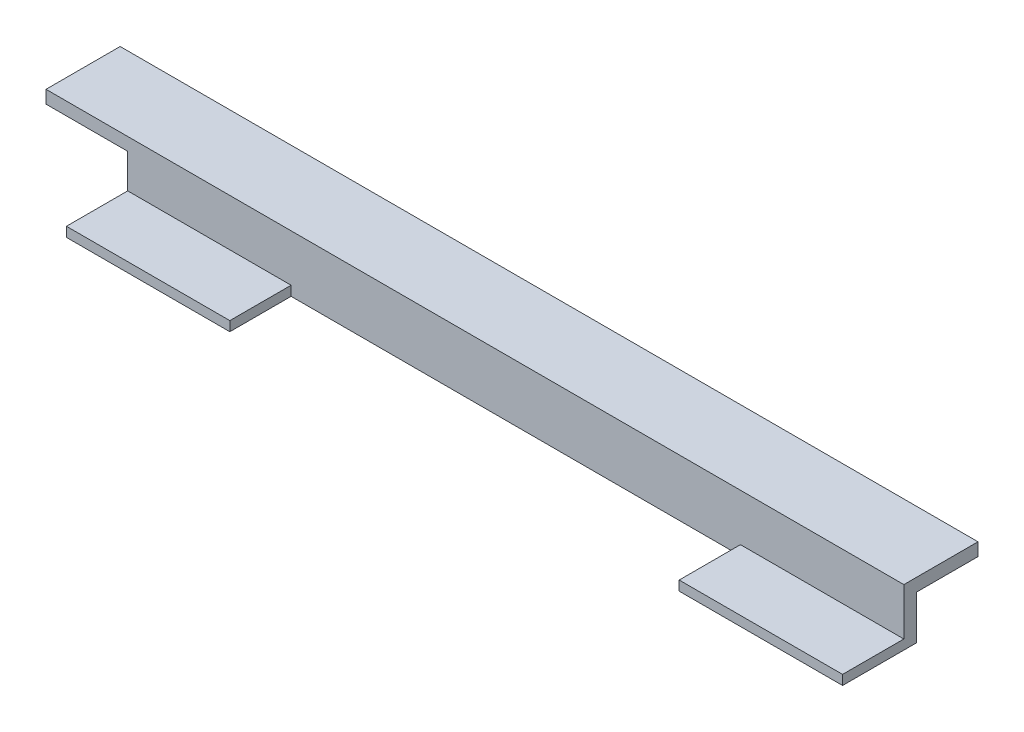
ISO-10303-21;
HEADER;
FILE_DESCRIPTION(('STEP AP214'),'2;1');
FILE_NAME('part.step','',(''),(''),'','','');
FILE_SCHEMA(('AUTOMOTIVE_DESIGN { 1 0 10303 214 1 1 1 1 }'));
ENDSEC;
DATA;
#1=APPLICATION_CONTEXT('core data for automotive mechanical design processes');
#2=APPLICATION_PROTOCOL_DEFINITION('international standard','automotive_design',2000,#1);
#3=PRODUCT_CONTEXT('',#1,'mechanical');
#4=PRODUCT('Part','Part','',(#3));
#5=PRODUCT_RELATED_PRODUCT_CATEGORY('part','',(#4));
#6=PRODUCT_DEFINITION_FORMATION('','',#4);
#7=PRODUCT_DEFINITION_CONTEXT('part definition',#1,'design');
#8=PRODUCT_DEFINITION('design','',#6,#7);
#9=PRODUCT_DEFINITION_SHAPE('','',#8);
#10=(LENGTH_UNIT() NAMED_UNIT(*) SI_UNIT(.MILLI.,.METRE.));
#11=(NAMED_UNIT(*) PLANE_ANGLE_UNIT() SI_UNIT($,.RADIAN.));
#12=(NAMED_UNIT(*) SI_UNIT($,.STERADIAN.) SOLID_ANGLE_UNIT());
#13=UNCERTAINTY_MEASURE_WITH_UNIT(LENGTH_MEASURE(1.E-05),#10,'distance_accuracy_value','');
#14=(GEOMETRIC_REPRESENTATION_CONTEXT(3) GLOBAL_UNCERTAINTY_ASSIGNED_CONTEXT((#13)) GLOBAL_UNIT_ASSIGNED_CONTEXT((#10,
#11,#12)) REPRESENTATION_CONTEXT('',''));
#15=CARTESIAN_POINT('',(0.,0.,0.));
#16=DIRECTION('',(0.,0.,1.));
#17=DIRECTION('',(1.,0.,0.));
#18=AXIS2_PLACEMENT_3D('',#15,#16,#17);
#19=CARTESIAN_POINT('',(0.,0.,0.));
#20=DIRECTION('',(1.,0.,0.));
#21=DIRECTION('',(0.,0.,-1.));
#22=AXIS2_PLACEMENT_3D('',#19,#20,#21);
#23=PLANE('',#22);
#24=DIRECTION('',(0.,0.,1.));
#25=VECTOR('',#24,1.);
#26=CARTESIAN_POINT('',(0.,6.825996,-9.525));
#27=LINE('',#26,#25);
#28=CARTESIAN_POINT('',(0.,6.825996,0.));
#29=VERTEX_POINT('',#28);
#30=CARTESIAN_POINT('',(0.,6.825996,2.));
#31=VERTEX_POINT('',#30);
#32=EDGE_CURVE('E11',#29,#31,#27,.T.);
#33=ORIENTED_EDGE('',*,*,#32,.F.);
#34=DIRECTION('',(0.,-1.,0.));
#35=VECTOR('',#34,1.);
#36=CARTESIAN_POINT('',(0.,0.,0.));
#37=LINE('',#36,#35);
#38=CARTESIAN_POINT('',(0.,0.,0.));
#39=VERTEX_POINT('',#38);
#40=EDGE_CURVE('E171',#29,#39,#37,.T.);
#41=ORIENTED_EDGE('',*,*,#40,.T.);
#42=DIRECTION('',(0.,0.,1.));
#43=VECTOR('',#42,1.);
#44=CARTESIAN_POINT('',(0.,0.,0.));
#45=LINE('',#44,#43);
#46=CARTESIAN_POINT('',(0.,0.,11.525));
#47=VERTEX_POINT('',#46);
#48=EDGE_CURVE('E167',#39,#47,#45,.T.);
#49=ORIENTED_EDGE('',*,*,#48,.T.);
#50=DIRECTION('',(0.,-1.,0.));
#51=VECTOR('',#50,1.);
#52=CARTESIAN_POINT('',(0.,0.,11.525));
#53=LINE('',#52,#51);
#54=CARTESIAN_POINT('',(0.,1.5,11.525));
#55=VERTEX_POINT('',#54);
#56=EDGE_CURVE('E163',#55,#47,#53,.T.);
#57=ORIENTED_EDGE('',*,*,#56,.F.);
#58=DIRECTION('',(0.,0.,1.));
#59=VECTOR('',#58,1.);
#60=CARTESIAN_POINT('',(0.,1.5,0.));
#61=LINE('',#60,#59);
#62=CARTESIAN_POINT('',(0.,1.5,2.));
#63=VERTEX_POINT('',#62);
#64=EDGE_CURVE('E158',#63,#55,#61,.T.);
#65=ORIENTED_EDGE('',*,*,#64,.F.);
#66=DIRECTION('',(0.,1.,0.));
#67=VECTOR('',#66,1.);
#68=CARTESIAN_POINT('',(0.,0.,2.));
#69=LINE('',#68,#67);
#70=EDGE_CURVE('E155',#63,#31,#69,.T.);
#71=ORIENTED_EDGE('',*,*,#70,.T.);
#72=EDGE_LOOP('',(#33,#41,#49,#57,#65,#71));
#73=FACE_BOUND('',#72,.T.);
#74=ADVANCED_FACE('F41',(#73),#23,.F.);
#75=CARTESIAN_POINT('',(120.65,1.5,0.));
#76=DIRECTION('',(0.,-1.,0.));
#77=DIRECTION('',(0.,0.,-1.));
#78=AXIS2_PLACEMENT_3D('',#75,#76,#77);
#79=PLANE('',#78);
#80=DIRECTION('',(-1.,0.,0.));
#81=VECTOR('',#80,1.);
#82=CARTESIAN_POINT('',(120.65,1.5,11.525));
#83=LINE('',#82,#81);
#84=CARTESIAN_POINT('',(25.4,1.5,11.525));
#85=VERTEX_POINT('',#84);
#86=EDGE_CURVE('E188',#85,#55,#83,.T.);
#87=ORIENTED_EDGE('',*,*,#86,.F.);
#88=DIRECTION('',(0.,0.,-1.));
#89=VECTOR('',#88,1.);
#90=CARTESIAN_POINT('',(25.4,1.5,0.));
#91=LINE('',#90,#89);
#92=CARTESIAN_POINT('',(25.4,1.5,2.));
#93=VERTEX_POINT('',#92);
#94=EDGE_CURVE('E159',#85,#93,#91,.T.);
#95=ORIENTED_EDGE('',*,*,#94,.T.);
#96=DIRECTION('',(-1.,0.,0.));
#97=VECTOR('',#96,1.);
#98=CARTESIAN_POINT('',(120.65,1.5,2.));
#99=LINE('',#98,#97);
#100=EDGE_CURVE('E192',#93,#63,#99,.T.);
#101=ORIENTED_EDGE('',*,*,#100,.T.);
#102=ORIENTED_EDGE('',*,*,#64,.T.);
#103=EDGE_LOOP('',(#87,#95,#101,#102));
#104=FACE_BOUND('',#103,.T.);
#105=ADVANCED_FACE('F210',(#104),#79,.F.);
#106=CARTESIAN_POINT('',(120.65,0.,11.525));
#107=DIRECTION('',(0.,0.,-1.));
#108=DIRECTION('',(-1.,0.,0.));
#109=AXIS2_PLACEMENT_3D('',#106,#107,#108);
#110=PLANE('',#109);
#111=DIRECTION('',(-1.,0.,0.));
#112=VECTOR('',#111,1.);
#113=CARTESIAN_POINT('',(120.65,0.,11.525));
#114=LINE('',#113,#112);
#115=CARTESIAN_POINT('',(25.4,0.,11.525));
#116=VERTEX_POINT('',#115);
#117=EDGE_CURVE('E184',#116,#47,#114,.T.);
#118=ORIENTED_EDGE('',*,*,#117,.F.);
#119=DIRECTION('',(0.,-1.,0.));
#120=VECTOR('',#119,1.);
#121=CARTESIAN_POINT('',(25.4,8.825996,11.525));
#122=LINE('',#121,#120);
#123=EDGE_CURVE('E206',#85,#116,#122,.T.);
#124=ORIENTED_EDGE('',*,*,#123,.F.);
#125=ORIENTED_EDGE('',*,*,#86,.T.);
#126=ORIENTED_EDGE('',*,*,#56,.T.);
#127=EDGE_LOOP('',(#118,#124,#125,#126));
#128=FACE_BOUND('',#127,.T.);
#129=ADVANCED_FACE('F204',(#128),#110,.F.);
#130=CARTESIAN_POINT('',(120.65,0.,2.));
#131=DIRECTION('',(0.,0.,1.));
#132=DIRECTION('',(1.,0.,0.));
#133=AXIS2_PLACEMENT_3D('',#130,#131,#132);
#134=PLANE('',#133);
#135=DIRECTION('',(-1.,0.,0.));
#136=VECTOR('',#135,1.);
#137=CARTESIAN_POINT('',(120.65,8.825996,2.));
#138=LINE('',#137,#136);
#139=CARTESIAN_POINT('',(120.65,8.825996,2.));
#140=VERTEX_POINT('',#139);
#141=CARTESIAN_POINT('',(-12.7,8.825996,2.));
#142=VERTEX_POINT('',#141);
#143=EDGE_CURVE('E67',#140,#142,#138,.T.);
#144=ORIENTED_EDGE('',*,*,#143,.T.);
#145=DIRECTION('',(0.,1.,0.));
#146=VECTOR('',#145,1.);
#147=CARTESIAN_POINT('',(-12.7,6.825996,2.));
#148=LINE('',#147,#146);
#149=CARTESIAN_POINT('',(-12.7,6.825996,2.));
#150=VERTEX_POINT('',#149);
#151=EDGE_CURVE('E266',#150,#142,#148,.T.);
#152=ORIENTED_EDGE('',*,*,#151,.F.);
#153=DIRECTION('',(1.,0.,0.));
#154=VECTOR('',#153,1.);
#155=CARTESIAN_POINT('',(-12.7,6.825996,2.));
#156=LINE('',#155,#154);
#157=EDGE_CURVE('E262',#150,#31,#156,.T.);
#158=ORIENTED_EDGE('',*,*,#157,.T.);
#159=ORIENTED_EDGE('',*,*,#70,.F.);
#160=ORIENTED_EDGE('',*,*,#100,.F.);
#161=DIRECTION('',(0.,-1.,0.));
#162=VECTOR('',#161,1.);
#163=CARTESIAN_POINT('',(25.4,8.825996,2.));
#164=LINE('',#163,#162);
#165=CARTESIAN_POINT('',(25.4,0.,2.));
#166=VERTEX_POINT('',#165);
#167=EDGE_CURVE('E238',#93,#166,#164,.T.);
#168=ORIENTED_EDGE('',*,*,#167,.T.);
#169=DIRECTION('',(1.,0.,0.));
#170=VECTOR('',#169,1.);
#171=CARTESIAN_POINT('',(25.4,0.,2.));
#172=LINE('',#171,#170);
#173=CARTESIAN_POINT('',(95.25,0.,2.));
#174=VERTEX_POINT('',#173);
#175=EDGE_CURVE('E272',#166,#174,#172,.T.);
#176=ORIENTED_EDGE('',*,*,#175,.T.);
#177=DIRECTION('',(0.,-1.,0.));
#178=VECTOR('',#177,1.);
#179=CARTESIAN_POINT('',(95.25,8.825996,2.));
#180=LINE('',#179,#178);
#181=CARTESIAN_POINT('',(95.25,1.5,2.));
#182=VERTEX_POINT('',#181);
#183=EDGE_CURVE('E287',#182,#174,#180,.T.);
#184=ORIENTED_EDGE('',*,*,#183,.F.);
#185=CARTESIAN_POINT('',(120.65,1.5,2.));
#186=VERTEX_POINT('',#185);
#187=EDGE_CURVE('E45',#186,#182,#99,.T.);
#188=ORIENTED_EDGE('',*,*,#187,.F.);
#189=DIRECTION('',(0.,1.,0.));
#190=VECTOR('',#189,1.);
#191=CARTESIAN_POINT('',(120.65,0.,2.));
#192=LINE('',#191,#190);
#193=EDGE_CURVE('E174',#186,#140,#192,.T.);
#194=ORIENTED_EDGE('',*,*,#193,.T.);
#195=EDGE_LOOP('',(#144,#152,#158,#159,#160,#168,#176,#184,#188,#194));
#196=FACE_BOUND('',#195,.T.);
#197=ADVANCED_FACE('F43',(#196),#134,.T.);
#198=ORIENTED_EDGE('',*,*,#187,.T.);
#199=DIRECTION('',(0.,0.,1.));
#200=VECTOR('',#199,1.);
#201=CARTESIAN_POINT('',(95.25,1.5,0.));
#202=LINE('',#201,#200);
#203=CARTESIAN_POINT('',(95.25,1.5,11.525));
#204=VERTEX_POINT('',#203);
#205=EDGE_CURVE('E240',#182,#204,#202,.T.);
#206=ORIENTED_EDGE('',*,*,#205,.T.);
#207=CARTESIAN_POINT('',(120.65,1.5,11.525));
#208=VERTEX_POINT('',#207);
#209=EDGE_CURVE('E189',#208,#204,#83,.T.);
#210=ORIENTED_EDGE('',*,*,#209,.F.);
#211=DIRECTION('',(0.,0.,1.));
#212=VECTOR('',#211,1.);
#213=CARTESIAN_POINT('',(120.65,1.5,0.));
#214=LINE('',#213,#212);
#215=EDGE_CURVE('E248',#186,#208,#214,.T.);
#216=ORIENTED_EDGE('',*,*,#215,.F.);
#217=EDGE_LOOP('',(#198,#206,#210,#216));
#218=FACE_BOUND('',#217,.T.);
#219=ADVANCED_FACE('F297',(#218),#79,.F.);
#220=ORIENTED_EDGE('',*,*,#209,.T.);
#221=DIRECTION('',(0.,-1.,0.));
#222=VECTOR('',#221,1.);
#223=CARTESIAN_POINT('',(95.25,8.825996,11.525));
#224=LINE('',#223,#222);
#225=CARTESIAN_POINT('',(95.25,0.,11.525));
#226=VERTEX_POINT('',#225);
#227=EDGE_CURVE('E235',#204,#226,#224,.T.);
#228=ORIENTED_EDGE('',*,*,#227,.T.);
#229=CARTESIAN_POINT('',(120.65,0.,11.525));
#230=VERTEX_POINT('',#229);
#231=EDGE_CURVE('E185',#230,#226,#114,.T.);
#232=ORIENTED_EDGE('',*,*,#231,.F.);
#233=DIRECTION('',(0.,-1.,0.));
#234=VECTOR('',#233,1.);
#235=CARTESIAN_POINT('',(120.65,0.,11.525));
#236=LINE('',#235,#234);
#237=EDGE_CURVE('E251',#208,#230,#236,.T.);
#238=ORIENTED_EDGE('',*,*,#237,.F.);
#239=EDGE_LOOP('',(#220,#228,#232,#238));
#240=FACE_BOUND('',#239,.T.);
#241=ADVANCED_FACE('F295',(#240),#110,.F.);
#242=CARTESIAN_POINT('',(120.65,0.,0.));
#243=DIRECTION('',(0.,-1.,0.));
#244=DIRECTION('',(0.,0.,-1.));
#245=AXIS2_PLACEMENT_3D('',#242,#243,#244);
#246=PLANE('',#245);
#247=DIRECTION('',(0.,0.,-1.));
#248=VECTOR('',#247,1.);
#249=CARTESIAN_POINT('',(25.4,0.,2.));
#250=LINE('',#249,#248);
#251=EDGE_CURVE('E58',#116,#166,#250,.T.);
#252=ORIENTED_EDGE('',*,*,#251,.F.);
#253=ORIENTED_EDGE('',*,*,#117,.T.);
#254=ORIENTED_EDGE('',*,*,#48,.F.);
#255=DIRECTION('',(-1.,0.,0.));
#256=VECTOR('',#255,1.);
#257=CARTESIAN_POINT('',(120.65,0.,0.));
#258=LINE('',#257,#256);
#259=CARTESIAN_POINT('',(120.65,0.,0.));
#260=VERTEX_POINT('',#259);
#261=EDGE_CURVE('E181',#260,#39,#258,.T.);
#262=ORIENTED_EDGE('',*,*,#261,.F.);
#263=DIRECTION('',(0.,0.,1.));
#264=VECTOR('',#263,1.);
#265=CARTESIAN_POINT('',(120.65,0.,0.));
#266=LINE('',#265,#264);
#267=EDGE_CURVE('E254',#260,#230,#266,.T.);
#268=ORIENTED_EDGE('',*,*,#267,.T.);
#269=ORIENTED_EDGE('',*,*,#231,.T.);
#270=DIRECTION('',(0.,0.,1.));
#271=VECTOR('',#270,1.);
#272=CARTESIAN_POINT('',(95.25,0.,2.));
#273=LINE('',#272,#271);
#274=EDGE_CURVE('E280',#174,#226,#273,.T.);
#275=ORIENTED_EDGE('',*,*,#274,.F.);
#276=ORIENTED_EDGE('',*,*,#175,.F.);
#277=EDGE_LOOP('',(#252,#253,#254,#262,#268,#269,#275,#276));
#278=FACE_BOUND('',#277,.T.);
#279=ADVANCED_FACE('F216',(#278),#246,.T.);
#280=CARTESIAN_POINT('',(120.65,0.,0.));
#281=DIRECTION('',(0.,0.,-1.));
#282=DIRECTION('',(0.,1.,0.));
#283=AXIS2_PLACEMENT_3D('',#280,#281,#282);
#284=PLANE('',#283);
#285=ORIENTED_EDGE('',*,*,#40,.F.);
#286=DIRECTION('',(-1.,0.,0.));
#287=VECTOR('',#286,1.);
#288=CARTESIAN_POINT('',(120.65,6.825996,0.));
#289=LINE('',#288,#287);
#290=CARTESIAN_POINT('',(120.65,6.825996,0.));
#291=VERTEX_POINT('',#290);
#292=EDGE_CURVE('E131',#291,#29,#289,.T.);
#293=ORIENTED_EDGE('',*,*,#292,.F.);
#294=DIRECTION('',(0.,-1.,0.));
#295=VECTOR('',#294,1.);
#296=CARTESIAN_POINT('',(120.65,0.,0.));
#297=LINE('',#296,#295);
#298=EDGE_CURVE('E143',#291,#260,#297,.T.);
#299=ORIENTED_EDGE('',*,*,#298,.T.);
#300=ORIENTED_EDGE('',*,*,#261,.T.);
#301=EDGE_LOOP('',(#285,#293,#299,#300));
#302=FACE_BOUND('',#301,.T.);
#303=ADVANCED_FACE('F258',(#302),#284,.T.);
#304=CARTESIAN_POINT('',(120.65,6.825996,0.));
#305=DIRECTION('',(0.,-1.,0.));
#306=DIRECTION('',(0.,0.,-1.));
#307=AXIS2_PLACEMENT_3D('',#304,#305,#306);
#308=PLANE('',#307);
#309=ORIENTED_EDGE('',*,*,#292,.T.);
#310=ORIENTED_EDGE('',*,*,#32,.T.);
#311=ORIENTED_EDGE('',*,*,#157,.F.);
#312=DIRECTION('',(0.,0.,1.));
#313=VECTOR('',#312,1.);
#314=CARTESIAN_POINT('',(-12.7,6.825996,-9.525));
#315=LINE('',#314,#313);
#316=CARTESIAN_POINT('',(-12.7,6.825996,-9.525));
#317=VERTEX_POINT('',#316);
#318=EDGE_CURVE('E125',#317,#150,#315,.T.);
#319=ORIENTED_EDGE('',*,*,#318,.F.);
#320=DIRECTION('',(-1.,0.,0.));
#321=VECTOR('',#320,1.);
#322=CARTESIAN_POINT('',(120.65,6.825996,-9.525));
#323=LINE('',#322,#321);
#324=CARTESIAN_POINT('',(120.65,6.825996,-9.525));
#325=VERTEX_POINT('',#324);
#326=EDGE_CURVE('E118',#325,#317,#323,.T.);
#327=ORIENTED_EDGE('',*,*,#326,.F.);
#328=DIRECTION('',(0.,0.,1.));
#329=VECTOR('',#328,1.);
#330=CARTESIAN_POINT('',(120.65,6.825996,0.));
#331=LINE('',#330,#329);
#332=EDGE_CURVE('E121',#325,#291,#331,.T.);
#333=ORIENTED_EDGE('',*,*,#332,.T.);
#334=EDGE_LOOP('',(#309,#310,#311,#319,#327,#333));
#335=FACE_BOUND('',#334,.T.);
#336=ADVANCED_FACE('F120',(#335),#308,.T.);
#337=CARTESIAN_POINT('',(120.65,0.,-9.525));
#338=DIRECTION('',(0.,0.,-1.));
#339=DIRECTION('',(0.,1.,0.));
#340=AXIS2_PLACEMENT_3D('',#337,#338,#339);
#341=PLANE('',#340);
#342=ORIENTED_EDGE('',*,*,#326,.T.);
#343=DIRECTION('',(0.,-1.,0.));
#344=VECTOR('',#343,1.);
#345=CARTESIAN_POINT('',(-12.7,6.825996,-9.525));
#346=LINE('',#345,#344);
#347=CARTESIAN_POINT('',(-12.7,8.825996,-9.525));
#348=VERTEX_POINT('',#347);
#349=EDGE_CURVE('E448',#348,#317,#346,.T.);
#350=ORIENTED_EDGE('',*,*,#349,.F.);
#351=DIRECTION('',(-1.,0.,0.));
#352=VECTOR('',#351,1.);
#353=CARTESIAN_POINT('',(120.65,8.825996,-9.525));
#354=LINE('',#353,#352);
#355=CARTESIAN_POINT('',(120.65,8.825996,-9.525));
#356=VERTEX_POINT('',#355);
#357=EDGE_CURVE('E132',#356,#348,#354,.T.);
#358=ORIENTED_EDGE('',*,*,#357,.F.);
#359=DIRECTION('',(0.,-1.,0.));
#360=VECTOR('',#359,1.);
#361=CARTESIAN_POINT('',(120.65,0.,-9.525));
#362=LINE('',#361,#360);
#363=EDGE_CURVE('E140',#356,#325,#362,.T.);
#364=ORIENTED_EDGE('',*,*,#363,.T.);
#365=EDGE_LOOP('',(#342,#350,#358,#364));
#366=FACE_BOUND('',#365,.T.);
#367=ADVANCED_FACE('F146',(#366),#341,.T.);
#368=CARTESIAN_POINT('',(120.65,8.825996,0.));
#369=DIRECTION('',(0.,1.,0.));
#370=DIRECTION('',(0.,0.,1.));
#371=AXIS2_PLACEMENT_3D('',#368,#369,#370);
#372=PLANE('',#371);
#373=ORIENTED_EDGE('',*,*,#357,.T.);
#374=DIRECTION('',(0.,0.,-1.));
#375=VECTOR('',#374,1.);
#376=CARTESIAN_POINT('',(-12.7,8.825996,-9.525));
#377=LINE('',#376,#375);
#378=EDGE_CURVE('E268',#142,#348,#377,.T.);
#379=ORIENTED_EDGE('',*,*,#378,.F.);
#380=ORIENTED_EDGE('',*,*,#143,.F.);
#381=DIRECTION('',(0.,0.,-1.));
#382=VECTOR('',#381,1.);
#383=CARTESIAN_POINT('',(120.65,8.825996,0.));
#384=LINE('',#383,#382);
#385=EDGE_CURVE('E149',#140,#356,#384,.T.);
#386=ORIENTED_EDGE('',*,*,#385,.T.);
#387=EDGE_LOOP('',(#373,#379,#380,#386));
#388=FACE_BOUND('',#387,.T.);
#389=ADVANCED_FACE('F313',(#388),#372,.T.);
#390=CARTESIAN_POINT('',(120.65,0.,0.));
#391=DIRECTION('',(1.,0.,0.));
#392=DIRECTION('',(0.,0.,-1.));
#393=AXIS2_PLACEMENT_3D('',#390,#391,#392);
#394=PLANE('',#393);
#395=ORIENTED_EDGE('',*,*,#193,.F.);
#396=ORIENTED_EDGE('',*,*,#215,.T.);
#397=ORIENTED_EDGE('',*,*,#237,.T.);
#398=ORIENTED_EDGE('',*,*,#267,.F.);
#399=ORIENTED_EDGE('',*,*,#298,.F.);
#400=ORIENTED_EDGE('',*,*,#332,.F.);
#401=ORIENTED_EDGE('',*,*,#363,.F.);
#402=ORIENTED_EDGE('',*,*,#385,.F.);
#403=EDGE_LOOP('',(#395,#396,#397,#398,#399,#400,#401,#402));
#404=FACE_BOUND('',#403,.T.);
#405=ADVANCED_FACE('F138',(#404),#394,.T.);
#406=CARTESIAN_POINT('',(25.4,8.825996,2.));
#407=DIRECTION('',(-1.,0.,0.));
#408=DIRECTION('',(0.,0.,1.));
#409=AXIS2_PLACEMENT_3D('',#406,#407,#408);
#410=PLANE('',#409);
#411=ORIENTED_EDGE('',*,*,#123,.T.);
#412=ORIENTED_EDGE('',*,*,#251,.T.);
#413=ORIENTED_EDGE('',*,*,#167,.F.);
#414=ORIENTED_EDGE('',*,*,#94,.F.);
#415=EDGE_LOOP('',(#411,#412,#413,#414));
#416=FACE_BOUND('',#415,.T.);
#417=ADVANCED_FACE('F237',(#416),#410,.F.);
#418=CARTESIAN_POINT('',(95.25,8.825996,2.));
#419=DIRECTION('',(1.,0.,0.));
#420=DIRECTION('',(0.,0.,-1.));
#421=AXIS2_PLACEMENT_3D('',#418,#419,#420);
#422=PLANE('',#421);
#423=ORIENTED_EDGE('',*,*,#183,.T.);
#424=ORIENTED_EDGE('',*,*,#274,.T.);
#425=ORIENTED_EDGE('',*,*,#227,.F.);
#426=ORIENTED_EDGE('',*,*,#205,.F.);
#427=EDGE_LOOP('',(#423,#424,#425,#426));
#428=FACE_BOUND('',#427,.T.);
#429=ADVANCED_FACE('F294',(#428),#422,.F.);
#430=CARTESIAN_POINT('',(-12.7,0.,0.));
#431=DIRECTION('',(1.,0.,0.));
#432=DIRECTION('',(0.,0.,-1.));
#433=AXIS2_PLACEMENT_3D('',#430,#431,#432);
#434=PLANE('',#433);
#435=ORIENTED_EDGE('',*,*,#349,.T.);
#436=ORIENTED_EDGE('',*,*,#318,.T.);
#437=ORIENTED_EDGE('',*,*,#151,.T.);
#438=ORIENTED_EDGE('',*,*,#378,.T.);
#439=EDGE_LOOP('',(#435,#436,#437,#438));
#440=FACE_BOUND('',#439,.T.);
#441=ADVANCED_FACE('F362',(#440),#434,.F.);
#442=CLOSED_SHELL('',(#74,#105,#129,#197,#219,#241,#279,#303,#336,#367,#389,#405,#417,#429,#441));
#443=MANIFOLD_SOLID_BREP('B2',#442);
#444=ADVANCED_BREP_SHAPE_REPRESENTATION('',(#18,#443),#14);
#445=SHAPE_DEFINITION_REPRESENTATION(#9,#444);
ENDSEC;
END-ISO-10303-21;
